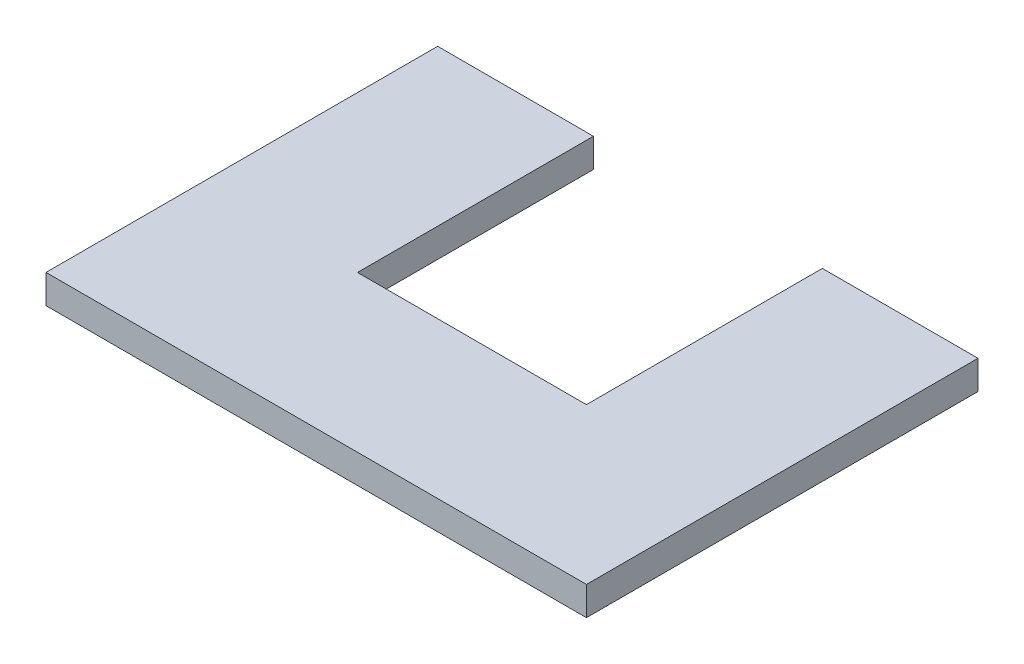
ISO-10303-21;
HEADER;
FILE_DESCRIPTION(('STEP AP214'),'2;1');
FILE_NAME('part.step','',(''),(''),'','','');
FILE_SCHEMA(('AUTOMOTIVE_DESIGN { 1 0 10303 214 1 1 1 1 }'));
ENDSEC;
DATA;
#1=APPLICATION_CONTEXT('core data for automotive mechanical design processes');
#2=APPLICATION_PROTOCOL_DEFINITION('international standard','automotive_design',2000,#1);
#3=PRODUCT_CONTEXT('',#1,'mechanical');
#4=PRODUCT('Part','Part','',(#3));
#5=PRODUCT_RELATED_PRODUCT_CATEGORY('part','',(#4));
#6=PRODUCT_DEFINITION_FORMATION('','',#4);
#7=PRODUCT_DEFINITION_CONTEXT('part definition',#1,'design');
#8=PRODUCT_DEFINITION('design','',#6,#7);
#9=PRODUCT_DEFINITION_SHAPE('','',#8);
#10=(LENGTH_UNIT() NAMED_UNIT(*) SI_UNIT(.MILLI.,.METRE.));
#11=(NAMED_UNIT(*) PLANE_ANGLE_UNIT() SI_UNIT($,.RADIAN.));
#12=(NAMED_UNIT(*) SI_UNIT($,.STERADIAN.) SOLID_ANGLE_UNIT());
#13=UNCERTAINTY_MEASURE_WITH_UNIT(LENGTH_MEASURE(1.E-05),#10,'distance_accuracy_value','');
#14=(GEOMETRIC_REPRESENTATION_CONTEXT(3) GLOBAL_UNCERTAINTY_ASSIGNED_CONTEXT((#13)) GLOBAL_UNIT_ASSIGNED_CONTEXT((#10,
#11,#12)) REPRESENTATION_CONTEXT('',''));
#15=CARTESIAN_POINT('',(0.,0.,0.));
#16=DIRECTION('',(0.,0.,1.));
#17=DIRECTION('',(1.,0.,0.));
#18=AXIS2_PLACEMENT_3D('',#15,#16,#17);
#19=CARTESIAN_POINT('',(-8.34567494690366,3.175,-26.0830740240629));
#20=DIRECTION('',(0.,0.,1.));
#21=DIRECTION('',(1.,0.,0.));
#22=AXIS2_PLACEMENT_3D('',#19,#20,#21);
#23=PLANE('',#22);
#24=DIRECTION('',(-1.,0.,0.));
#25=VECTOR('',#24,1.);
#26=CARTESIAN_POINT('',(-8.34567494690366,0.,-26.0830740240629));
#27=LINE('',#26,#25);
#28=CARTESIAN_POINT('',(8.8241353778621,0.,-26.0830740240629));
#29=VERTEX_POINT('',#28);
#30=CARTESIAN_POINT('',(-8.34567494690366,0.,-26.0830740240629));
#31=VERTEX_POINT('',#30);
#32=EDGE_CURVE('E132',#29,#31,#27,.T.);
#33=ORIENTED_EDGE('',*,*,#32,.T.);
#34=DIRECTION('',(0.,-1.,0.));
#35=VECTOR('',#34,1.);
#36=CARTESIAN_POINT('',(-8.34567494690366,3.175,-26.0830740240629));
#37=LINE('',#36,#35);
#38=CARTESIAN_POINT('',(-8.34567494690366,3.175,-26.0830740240629));
#39=VERTEX_POINT('',#38);
#40=EDGE_CURVE('E42',#39,#31,#37,.T.);
#41=ORIENTED_EDGE('',*,*,#40,.F.);
#42=DIRECTION('',(-1.,0.,0.));
#43=VECTOR('',#42,1.);
#44=CARTESIAN_POINT('',(-8.34567494690366,3.175,-26.0830740240629));
#45=LINE('',#44,#43);
#46=CARTESIAN_POINT('',(8.8241353778621,3.175,-26.0830740240629));
#47=VERTEX_POINT('',#46);
#48=EDGE_CURVE('E92',#47,#39,#45,.T.);
#49=ORIENTED_EDGE('',*,*,#48,.F.);
#50=DIRECTION('',(0.,-1.,0.));
#51=VECTOR('',#50,1.);
#52=CARTESIAN_POINT('',(8.8241353778621,3.175,-26.0830740240629));
#53=LINE('',#52,#51);
#54=EDGE_CURVE('E11',#47,#29,#53,.T.);
#55=ORIENTED_EDGE('',*,*,#54,.T.);
#56=EDGE_LOOP('',(#33,#41,#49,#55));
#57=FACE_BOUND('',#56,.T.);
#58=ADVANCED_FACE('F34',(#57),#23,.F.);
#59=CARTESIAN_POINT('',(-8.34567494690366,3.175,17.0812655055085));
#60=DIRECTION('',(1.,0.,0.));
#61=DIRECTION('',(0.,0.,-1.));
#62=AXIS2_PLACEMENT_3D('',#59,#60,#61);
#63=PLANE('',#62);
#64=DIRECTION('',(0.,0.,1.));
#65=VECTOR('',#64,1.);
#66=CARTESIAN_POINT('',(-8.34567494690366,0.,17.0812655055085));
#67=LINE('',#66,#65);
#68=CARTESIAN_POINT('',(-8.34567494690366,0.,17.0812655055085));
#69=VERTEX_POINT('',#68);
#70=EDGE_CURVE('E134',#31,#69,#67,.T.);
#71=ORIENTED_EDGE('',*,*,#70,.T.);
#72=DIRECTION('',(0.,-1.,0.));
#73=VECTOR('',#72,1.);
#74=CARTESIAN_POINT('',(-8.34567494690366,3.175,17.0812655055085));
#75=LINE('',#74,#73);
#76=CARTESIAN_POINT('',(-8.34567494690366,3.175,17.0812655055085));
#77=VERTEX_POINT('',#76);
#78=EDGE_CURVE('E153',#77,#69,#75,.T.);
#79=ORIENTED_EDGE('',*,*,#78,.F.);
#80=DIRECTION('',(0.,0.,1.));
#81=VECTOR('',#80,1.);
#82=CARTESIAN_POINT('',(-8.34567494690366,3.175,17.0812655055085));
#83=LINE('',#82,#81);
#84=EDGE_CURVE('E161',#39,#77,#83,.T.);
#85=ORIENTED_EDGE('',*,*,#84,.F.);
#86=ORIENTED_EDGE('',*,*,#40,.T.);
#87=EDGE_LOOP('',(#71,#79,#85,#86));
#88=FACE_BOUND('',#87,.T.);
#89=ADVANCED_FACE('F159',(#88),#63,.F.);
#90=CARTESIAN_POINT('',(51.2207121829406,3.175,17.0812655055085));
#91=DIRECTION('',(0.,0.,-1.));
#92=DIRECTION('',(-1.,0.,0.));
#93=AXIS2_PLACEMENT_3D('',#90,#91,#92);
#94=PLANE('',#93);
#95=DIRECTION('',(1.,0.,0.));
#96=VECTOR('',#95,1.);
#97=CARTESIAN_POINT('',(51.2207121829406,0.,17.0812655055085));
#98=LINE('',#97,#96);
#99=CARTESIAN_POINT('',(51.2207121829406,0.,17.0812655055085));
#100=VERTEX_POINT('',#99);
#101=EDGE_CURVE('E136',#69,#100,#98,.T.);
#102=ORIENTED_EDGE('',*,*,#101,.T.);
#103=DIRECTION('',(0.,-1.,0.));
#104=VECTOR('',#103,1.);
#105=CARTESIAN_POINT('',(51.2207121829406,3.175,17.0812655055085));
#106=LINE('',#105,#104);
#107=CARTESIAN_POINT('',(51.2207121829406,3.175,17.0812655055085));
#108=VERTEX_POINT('',#107);
#109=EDGE_CURVE('E150',#108,#100,#106,.T.);
#110=ORIENTED_EDGE('',*,*,#109,.F.);
#111=DIRECTION('',(1.,0.,0.));
#112=VECTOR('',#111,1.);
#113=CARTESIAN_POINT('',(51.2207121829406,3.175,17.0812655055085));
#114=LINE('',#113,#112);
#115=EDGE_CURVE('E172',#77,#108,#114,.T.);
#116=ORIENTED_EDGE('',*,*,#115,.F.);
#117=ORIENTED_EDGE('',*,*,#78,.T.);
#118=EDGE_LOOP('',(#102,#110,#116,#117));
#119=FACE_BOUND('',#118,.T.);
#120=ADVANCED_FACE('F168',(#119),#94,.F.);
#121=CARTESIAN_POINT('',(51.2104230784834,3.175,-26.0830740240629));
#122=DIRECTION('',(-0.999999971589758,0.,0.000238370476115788));
#123=DIRECTION('',(0.000238370476115788,0.,0.999999971589758));
#124=AXIS2_PLACEMENT_3D('',#121,#122,#123);
#125=PLANE('',#124);
#126=DIRECTION('',(-0.000238370476115788,0.,-0.999999971589758));
#127=VECTOR('',#126,1.);
#128=CARTESIAN_POINT('',(51.2104230784834,0.,-26.0830740240629));
#129=LINE('',#128,#127);
#130=CARTESIAN_POINT('',(51.2104230784834,0.,-26.0830740240629));
#131=VERTEX_POINT('',#130);
#132=EDGE_CURVE('E138',#100,#131,#129,.T.);
#133=ORIENTED_EDGE('',*,*,#132,.T.);
#134=DIRECTION('',(0.,-1.,0.));
#135=VECTOR('',#134,1.);
#136=CARTESIAN_POINT('',(51.2104230784834,3.175,-26.0830740240629));
#137=LINE('',#136,#135);
#138=CARTESIAN_POINT('',(51.2104230784834,3.175,-26.0830740240629));
#139=VERTEX_POINT('',#138);
#140=EDGE_CURVE('E123',#139,#131,#137,.T.);
#141=ORIENTED_EDGE('',*,*,#140,.F.);
#142=DIRECTION('',(-0.000238370476115788,0.,-0.999999971589758));
#143=VECTOR('',#142,1.);
#144=CARTESIAN_POINT('',(51.2104230784834,3.175,-26.0830740240629));
#145=LINE('',#144,#143);
#146=EDGE_CURVE('E112',#108,#139,#145,.T.);
#147=ORIENTED_EDGE('',*,*,#146,.F.);
#148=ORIENTED_EDGE('',*,*,#109,.T.);
#149=EDGE_LOOP('',(#133,#141,#147,#148));
#150=FACE_BOUND('',#149,.T.);
#151=ADVANCED_FACE('F171',(#150),#125,.F.);
#152=CARTESIAN_POINT('',(34.0563880704651,3.175,-26.0830740240629));
#153=DIRECTION('',(0.,0.,1.));
#154=DIRECTION('',(1.,0.,0.));
#155=AXIS2_PLACEMENT_3D('',#152,#153,#154);
#156=PLANE('',#155);
#157=DIRECTION('',(-1.,0.,0.));
#158=VECTOR('',#157,1.);
#159=CARTESIAN_POINT('',(34.0563880704651,0.,-26.0830740240629));
#160=LINE('',#159,#158);
#161=CARTESIAN_POINT('',(34.0563880704651,0.,-26.0830740240629));
#162=VERTEX_POINT('',#161);
#163=EDGE_CURVE('E121',#131,#162,#160,.T.);
#164=ORIENTED_EDGE('',*,*,#163,.T.);
#165=DIRECTION('',(0.,-1.,0.));
#166=VECTOR('',#165,1.);
#167=CARTESIAN_POINT('',(34.0563880704651,3.175,-26.0830740240629));
#168=LINE('',#167,#166);
#169=CARTESIAN_POINT('',(34.0563880704651,3.175,-26.0830740240629));
#170=VERTEX_POINT('',#169);
#171=EDGE_CURVE('E118',#170,#162,#168,.T.);
#172=ORIENTED_EDGE('',*,*,#171,.F.);
#173=DIRECTION('',(-1.,0.,0.));
#174=VECTOR('',#173,1.);
#175=CARTESIAN_POINT('',(34.0563880704651,3.175,-26.0830740240629));
#176=LINE('',#175,#174);
#177=EDGE_CURVE('E105',#139,#170,#176,.T.);
#178=ORIENTED_EDGE('',*,*,#177,.F.);
#179=ORIENTED_EDGE('',*,*,#140,.T.);
#180=EDGE_LOOP('',(#164,#172,#178,#179));
#181=FACE_BOUND('',#180,.T.);
#182=ADVANCED_FACE('F119',(#181),#156,.F.);
#183=CARTESIAN_POINT('',(34.0563880704651,3.175,-0.0799750576597448));
#184=DIRECTION('',(1.,0.,0.));
#185=DIRECTION('',(0.,0.,-1.));
#186=AXIS2_PLACEMENT_3D('',#183,#184,#185);
#187=PLANE('',#186);
#188=DIRECTION('',(0.,0.,1.));
#189=VECTOR('',#188,1.);
#190=CARTESIAN_POINT('',(34.0563880704651,0.,-0.0799750576597448));
#191=LINE('',#190,#189);
#192=CARTESIAN_POINT('',(34.0563880704651,0.,-0.0799750576597448));
#193=VERTEX_POINT('',#192);
#194=EDGE_CURVE('E141',#162,#193,#191,.T.);
#195=ORIENTED_EDGE('',*,*,#194,.T.);
#196=DIRECTION('',(0.,-1.,0.));
#197=VECTOR('',#196,1.);
#198=CARTESIAN_POINT('',(34.0563880704651,3.175,-0.0799750576597448));
#199=LINE('',#198,#197);
#200=CARTESIAN_POINT('',(34.0563880704651,3.175,-0.0799750576597448));
#201=VERTEX_POINT('',#200);
#202=EDGE_CURVE('E124',#201,#193,#199,.T.);
#203=ORIENTED_EDGE('',*,*,#202,.F.);
#204=DIRECTION('',(0.,0.,1.));
#205=VECTOR('',#204,1.);
#206=CARTESIAN_POINT('',(34.0563880704651,3.175,-0.0799750576597448));
#207=LINE('',#206,#205);
#208=EDGE_CURVE('E109',#170,#201,#207,.T.);
#209=ORIENTED_EDGE('',*,*,#208,.F.);
#210=ORIENTED_EDGE('',*,*,#171,.T.);
#211=EDGE_LOOP('',(#195,#203,#209,#210));
#212=FACE_BOUND('',#211,.T.);
#213=ADVANCED_FACE('F126',(#212),#187,.F.);
#214=CARTESIAN_POINT('',(8.8241353778621,3.175,-0.0799750576597448));
#215=DIRECTION('',(0.,0.,1.));
#216=DIRECTION('',(1.,0.,0.));
#217=AXIS2_PLACEMENT_3D('',#214,#215,#216);
#218=PLANE('',#217);
#219=DIRECTION('',(-1.,0.,0.));
#220=VECTOR('',#219,1.);
#221=CARTESIAN_POINT('',(8.8241353778621,0.,-0.0799750576597448));
#222=LINE('',#221,#220);
#223=CARTESIAN_POINT('',(8.8241353778621,0.,-0.0799750576597448));
#224=VERTEX_POINT('',#223);
#225=EDGE_CURVE('E79',#193,#224,#222,.T.);
#226=ORIENTED_EDGE('',*,*,#225,.T.);
#227=DIRECTION('',(0.,-1.,0.));
#228=VECTOR('',#227,1.);
#229=CARTESIAN_POINT('',(8.8241353778621,3.175,-0.0799750576597448));
#230=LINE('',#229,#228);
#231=CARTESIAN_POINT('',(8.8241353778621,3.175,-0.0799750576597448));
#232=VERTEX_POINT('',#231);
#233=EDGE_CURVE('E128',#232,#224,#230,.T.);
#234=ORIENTED_EDGE('',*,*,#233,.F.);
#235=DIRECTION('',(-1.,0.,0.));
#236=VECTOR('',#235,1.);
#237=CARTESIAN_POINT('',(33.9658373879664,3.175,-0.0799750576597448));
#238=LINE('',#237,#236);
#239=EDGE_CURVE('E50',#201,#232,#238,.T.);
#240=ORIENTED_EDGE('',*,*,#239,.F.);
#241=ORIENTED_EDGE('',*,*,#202,.T.);
#242=EDGE_LOOP('',(#226,#234,#240,#241));
#243=FACE_BOUND('',#242,.T.);
#244=ADVANCED_FACE('F195',(#243),#218,.F.);
#245=CARTESIAN_POINT('',(8.8241353778621,3.175,-0.168883159933696));
#246=DIRECTION('',(-1.,0.,0.));
#247=DIRECTION('',(0.,0.,1.));
#248=AXIS2_PLACEMENT_3D('',#245,#246,#247);
#249=PLANE('',#248);
#250=DIRECTION('',(0.,0.,-1.));
#251=VECTOR('',#250,1.);
#252=CARTESIAN_POINT('',(8.8241353778621,0.,-0.168883159933696));
#253=LINE('',#252,#251);
#254=EDGE_CURVE('E144',#224,#29,#253,.T.);
#255=ORIENTED_EDGE('',*,*,#254,.T.);
#256=ORIENTED_EDGE('',*,*,#54,.F.);
#257=DIRECTION('',(0.,0.,-1.));
#258=VECTOR('',#257,1.);
#259=CARTESIAN_POINT('',(8.8241353778621,3.175,-26.0830740240629));
#260=LINE('',#259,#258);
#261=EDGE_CURVE('E146',#232,#47,#260,.T.);
#262=ORIENTED_EDGE('',*,*,#261,.F.);
#263=ORIENTED_EDGE('',*,*,#233,.T.);
#264=EDGE_LOOP('',(#255,#256,#262,#263));
#265=FACE_BOUND('',#264,.T.);
#266=ADVANCED_FACE('F179',(#265),#249,.F.);
#267=CARTESIAN_POINT('',(0.,3.175,0.));
#268=DIRECTION('',(0.,1.,0.));
#269=DIRECTION('',(0.,0.,1.));
#270=AXIS2_PLACEMENT_3D('',#267,#268,#269);
#271=PLANE('',#270);
#272=ORIENTED_EDGE('',*,*,#261,.T.);
#273=ORIENTED_EDGE('',*,*,#48,.T.);
#274=ORIENTED_EDGE('',*,*,#84,.T.);
#275=ORIENTED_EDGE('',*,*,#115,.T.);
#276=ORIENTED_EDGE('',*,*,#146,.T.);
#277=ORIENTED_EDGE('',*,*,#177,.T.);
#278=ORIENTED_EDGE('',*,*,#208,.T.);
#279=ORIENTED_EDGE('',*,*,#239,.T.);
#280=EDGE_LOOP('',(#272,#273,#274,#275,#276,#277,#278,#279));
#281=FACE_BOUND('',#280,.T.);
#282=ADVANCED_FACE('F107',(#281),#271,.T.);
#283=CARTESIAN_POINT('',(0.,0.,0.));
#284=DIRECTION('',(0.,1.,0.));
#285=DIRECTION('',(0.,0.,1.));
#286=AXIS2_PLACEMENT_3D('',#283,#284,#285);
#287=PLANE('',#286);
#288=ORIENTED_EDGE('',*,*,#32,.F.);
#289=ORIENTED_EDGE('',*,*,#254,.F.);
#290=ORIENTED_EDGE('',*,*,#225,.F.);
#291=ORIENTED_EDGE('',*,*,#194,.F.);
#292=ORIENTED_EDGE('',*,*,#163,.F.);
#293=ORIENTED_EDGE('',*,*,#132,.F.);
#294=ORIENTED_EDGE('',*,*,#101,.F.);
#295=ORIENTED_EDGE('',*,*,#70,.F.);
#296=EDGE_LOOP('',(#288,#289,#290,#291,#292,#293,#294,#295));
#297=FACE_BOUND('',#296,.T.);
#298=ADVANCED_FACE('F164',(#297),#287,.F.);
#299=CLOSED_SHELL('',(#58,#89,#120,#151,#182,#213,#244,#266,#282,#298));
#300=MANIFOLD_SOLID_BREP('B2',#299);
#301=ADVANCED_BREP_SHAPE_REPRESENTATION('',(#18,#300),#14);
#302=SHAPE_DEFINITION_REPRESENTATION(#9,#301);
ENDSEC;
END-ISO-10303-21;
